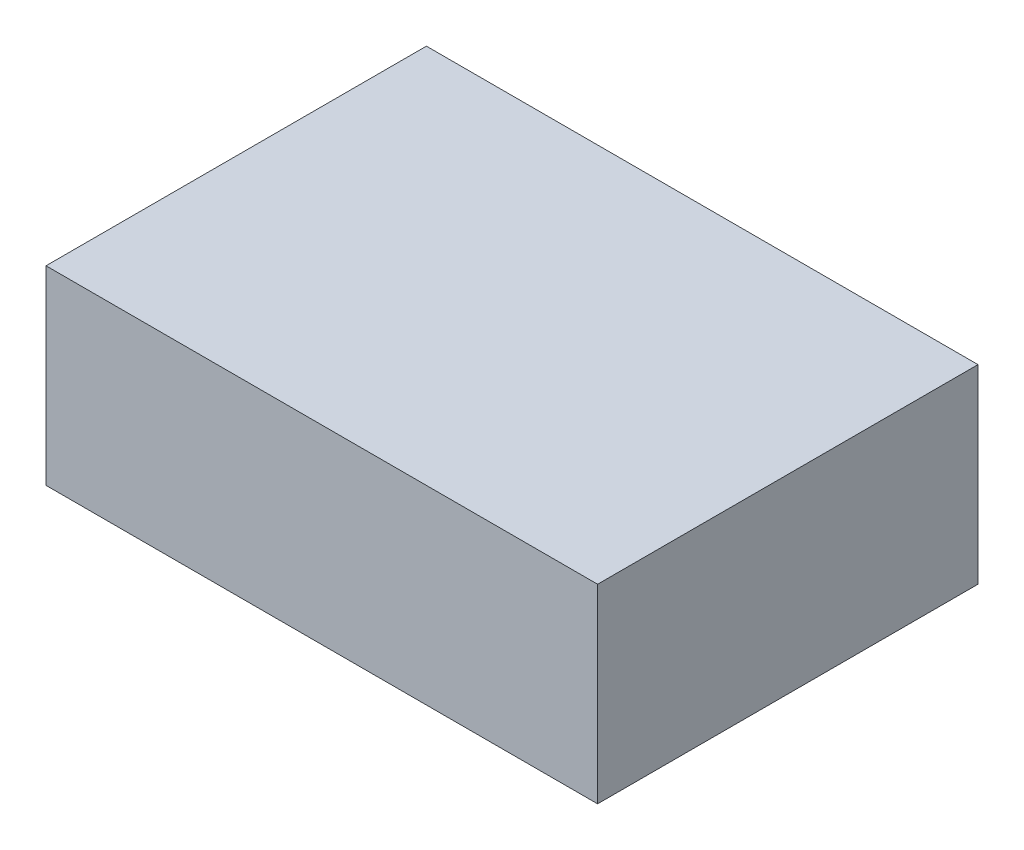
ISO-10303-21;
HEADER;
FILE_DESCRIPTION(('STEP AP214'),'2;1');
FILE_NAME('part.step','',(''),(''),'','','');
FILE_SCHEMA(('AUTOMOTIVE_DESIGN { 1 0 10303 214 1 1 1 1 }'));
ENDSEC;
DATA;
#1=APPLICATION_CONTEXT('core data for automotive mechanical design processes');
#2=APPLICATION_PROTOCOL_DEFINITION('international standard','automotive_design',2000,#1);
#3=PRODUCT_CONTEXT('',#1,'mechanical');
#4=PRODUCT('Part','Part','',(#3));
#5=PRODUCT_RELATED_PRODUCT_CATEGORY('part','',(#4));
#6=PRODUCT_DEFINITION_FORMATION('','',#4);
#7=PRODUCT_DEFINITION_CONTEXT('part definition',#1,'design');
#8=PRODUCT_DEFINITION('design','',#6,#7);
#9=PRODUCT_DEFINITION_SHAPE('','',#8);
#10=(LENGTH_UNIT() NAMED_UNIT(*) SI_UNIT(.MILLI.,.METRE.));
#11=(NAMED_UNIT(*) PLANE_ANGLE_UNIT() SI_UNIT($,.RADIAN.));
#12=(NAMED_UNIT(*) SI_UNIT($,.STERADIAN.) SOLID_ANGLE_UNIT());
#13=UNCERTAINTY_MEASURE_WITH_UNIT(LENGTH_MEASURE(1.E-05),#10,'distance_accuracy_value','');
#14=(GEOMETRIC_REPRESENTATION_CONTEXT(3) GLOBAL_UNCERTAINTY_ASSIGNED_CONTEXT((#13)) GLOBAL_UNIT_ASSIGNED_CONTEXT((#10,
#11,#12)) REPRESENTATION_CONTEXT('',''));
#15=CARTESIAN_POINT('',(0.,0.,0.));
#16=DIRECTION('',(0.,0.,1.));
#17=DIRECTION('',(1.,0.,0.));
#18=AXIS2_PLACEMENT_3D('',#15,#16,#17);
#19=CARTESIAN_POINT('',(0.72499982,0.2499995,0.));
#20=DIRECTION('',(0.,-1.,0.));
#21=DIRECTION('',(-1.,0.,0.));
#22=AXIS2_PLACEMENT_3D('',#19,#20,#21);
#23=PLANE('',#22);
#24=DIRECTION('',(-1.,0.,0.));
#25=VECTOR('',#24,1.);
#26=CARTESIAN_POINT('',(0.72499982,0.2499995,0.));
#27=LINE('',#26,#25);
#28=CARTESIAN_POINT('',(0.72499982,0.2499995,0.));
#29=VERTEX_POINT('',#28);
#30=CARTESIAN_POINT('',(-0.72499982,0.2499995,0.));
#31=VERTEX_POINT('',#30);
#32=EDGE_CURVE('E11',#29,#31,#27,.T.);
#33=ORIENTED_EDGE('',*,*,#32,.T.);
#34=DIRECTION('',(0.,0.,1.));
#35=VECTOR('',#34,1.);
#36=CARTESIAN_POINT('',(-0.72499982,0.2499995,0.));
#37=LINE('',#36,#35);
#38=CARTESIAN_POINT('',(-0.72499982,0.2499995,1.00000054));
#39=VERTEX_POINT('',#38);
#40=EDGE_CURVE('E24',#31,#39,#37,.T.);
#41=ORIENTED_EDGE('',*,*,#40,.T.);
#42=DIRECTION('',(-1.,0.,0.));
#43=VECTOR('',#42,1.);
#44=CARTESIAN_POINT('',(0.72499982,0.2499995,1.00000054));
#45=LINE('',#44,#43);
#46=CARTESIAN_POINT('',(0.72499982,0.2499995,1.00000054));
#47=VERTEX_POINT('',#46);
#48=EDGE_CURVE('E87',#47,#39,#45,.T.);
#49=ORIENTED_EDGE('',*,*,#48,.F.);
#50=DIRECTION('',(0.,0.,1.));
#51=VECTOR('',#50,1.);
#52=CARTESIAN_POINT('',(0.72499982,0.2499995,0.));
#53=LINE('',#52,#51);
#54=EDGE_CURVE('E36',#29,#47,#53,.T.);
#55=ORIENTED_EDGE('',*,*,#54,.F.);
#56=EDGE_LOOP('',(#33,#41,#49,#55));
#57=FACE_BOUND('',#56,.T.);
#58=ADVANCED_FACE('F17',(#57),#23,.F.);
#59=CARTESIAN_POINT('',(-0.72499982,0.2499995,0.));
#60=DIRECTION('',(1.,0.,0.));
#61=DIRECTION('',(0.,-1.,0.));
#62=AXIS2_PLACEMENT_3D('',#59,#60,#61);
#63=PLANE('',#62);
#64=DIRECTION('',(0.,-1.,0.));
#65=VECTOR('',#64,1.);
#66=CARTESIAN_POINT('',(-0.72499982,0.2499995,0.));
#67=LINE('',#66,#65);
#68=CARTESIAN_POINT('',(-0.72499982,-0.2499995,0.));
#69=VERTEX_POINT('',#68);
#70=EDGE_CURVE('E84',#31,#69,#67,.T.);
#71=ORIENTED_EDGE('',*,*,#70,.T.);
#72=DIRECTION('',(0.,0.,1.));
#73=VECTOR('',#72,1.);
#74=CARTESIAN_POINT('',(-0.72499982,-0.2499995,0.));
#75=LINE('',#74,#73);
#76=CARTESIAN_POINT('',(-0.72499982,-0.2499995,1.00000054));
#77=VERTEX_POINT('',#76);
#78=EDGE_CURVE('E82',#69,#77,#75,.T.);
#79=ORIENTED_EDGE('',*,*,#78,.T.);
#80=DIRECTION('',(0.,-1.,0.));
#81=VECTOR('',#80,1.);
#82=CARTESIAN_POINT('',(-0.72499982,0.2499995,1.00000054));
#83=LINE('',#82,#81);
#84=EDGE_CURVE('E62',#39,#77,#83,.T.);
#85=ORIENTED_EDGE('',*,*,#84,.F.);
#86=ORIENTED_EDGE('',*,*,#40,.F.);
#87=EDGE_LOOP('',(#71,#79,#85,#86));
#88=FACE_BOUND('',#87,.T.);
#89=ADVANCED_FACE('F89',(#88),#63,.F.);
#90=CARTESIAN_POINT('',(-0.72499982,-0.2499995,0.));
#91=DIRECTION('',(0.,1.,0.));
#92=DIRECTION('',(1.,0.,0.));
#93=AXIS2_PLACEMENT_3D('',#90,#91,#92);
#94=PLANE('',#93);
#95=DIRECTION('',(1.,0.,0.));
#96=VECTOR('',#95,1.);
#97=CARTESIAN_POINT('',(-0.72499982,-0.2499995,0.));
#98=LINE('',#97,#96);
#99=CARTESIAN_POINT('',(0.72499982,-0.2499995,0.));
#100=VERTEX_POINT('',#99);
#101=EDGE_CURVE('E71',#69,#100,#98,.T.);
#102=ORIENTED_EDGE('',*,*,#101,.T.);
#103=DIRECTION('',(0.,0.,1.));
#104=VECTOR('',#103,1.);
#105=CARTESIAN_POINT('',(0.72499982,-0.2499995,0.));
#106=LINE('',#105,#104);
#107=CARTESIAN_POINT('',(0.72499982,-0.2499995,1.00000054));
#108=VERTEX_POINT('',#107);
#109=EDGE_CURVE('E65',#100,#108,#106,.T.);
#110=ORIENTED_EDGE('',*,*,#109,.T.);
#111=DIRECTION('',(1.,0.,0.));
#112=VECTOR('',#111,1.);
#113=CARTESIAN_POINT('',(-0.72499982,-0.2499995,1.00000054));
#114=LINE('',#113,#112);
#115=EDGE_CURVE('E57',#77,#108,#114,.T.);
#116=ORIENTED_EDGE('',*,*,#115,.F.);
#117=ORIENTED_EDGE('',*,*,#78,.F.);
#118=EDGE_LOOP('',(#102,#110,#116,#117));
#119=FACE_BOUND('',#118,.T.);
#120=ADVANCED_FACE('F69',(#119),#94,.F.);
#121=CARTESIAN_POINT('',(0.72499982,-0.2499995,0.));
#122=DIRECTION('',(-1.,0.,0.));
#123=DIRECTION('',(0.,1.,0.));
#124=AXIS2_PLACEMENT_3D('',#121,#122,#123);
#125=PLANE('',#124);
#126=DIRECTION('',(0.,1.,0.));
#127=VECTOR('',#126,1.);
#128=CARTESIAN_POINT('',(0.72499982,-0.2499995,0.));
#129=LINE('',#128,#127);
#130=EDGE_CURVE('E66',#100,#29,#129,.T.);
#131=ORIENTED_EDGE('',*,*,#130,.T.);
#132=ORIENTED_EDGE('',*,*,#54,.T.);
#133=DIRECTION('',(0.,1.,0.));
#134=VECTOR('',#133,1.);
#135=CARTESIAN_POINT('',(0.72499982,-0.2499995,1.00000054));
#136=LINE('',#135,#134);
#137=EDGE_CURVE('E61',#108,#47,#136,.T.);
#138=ORIENTED_EDGE('',*,*,#137,.F.);
#139=ORIENTED_EDGE('',*,*,#109,.F.);
#140=EDGE_LOOP('',(#131,#132,#138,#139));
#141=FACE_BOUND('',#140,.T.);
#142=ADVANCED_FACE('F76',(#141),#125,.F.);
#143=CARTESIAN_POINT('',(0.72499982,0.2499995,0.));
#144=DIRECTION('',(0.,0.,-1.));
#145=DIRECTION('',(-1.,0.,0.));
#146=AXIS2_PLACEMENT_3D('',#143,#144,#145);
#147=PLANE('',#146);
#148=ORIENTED_EDGE('',*,*,#130,.F.);
#149=ORIENTED_EDGE('',*,*,#101,.F.);
#150=ORIENTED_EDGE('',*,*,#70,.F.);
#151=ORIENTED_EDGE('',*,*,#32,.F.);
#152=EDGE_LOOP('',(#148,#149,#150,#151));
#153=FACE_BOUND('',#152,.T.);
#154=ADVANCED_FACE('F91',(#153),#147,.T.);
#155=CARTESIAN_POINT('',(0.72499982,0.2499995,1.00000054));
#156=DIRECTION('',(0.,0.,-1.));
#157=DIRECTION('',(-1.,0.,0.));
#158=AXIS2_PLACEMENT_3D('',#155,#156,#157);
#159=PLANE('',#158);
#160=ORIENTED_EDGE('',*,*,#48,.T.);
#161=ORIENTED_EDGE('',*,*,#84,.T.);
#162=ORIENTED_EDGE('',*,*,#115,.T.);
#163=ORIENTED_EDGE('',*,*,#137,.T.);
#164=EDGE_LOOP('',(#160,#161,#162,#163));
#165=FACE_BOUND('',#164,.T.);
#166=ADVANCED_FACE('F59',(#165),#159,.F.);
#167=CLOSED_SHELL('',(#58,#89,#120,#142,#154,#166));
#168=MANIFOLD_SOLID_BREP('B1',#167);
#169=ADVANCED_BREP_SHAPE_REPRESENTATION('',(#18,#168),#14);
#170=SHAPE_DEFINITION_REPRESENTATION(#9,#169);
ENDSEC;
END-ISO-10303-21;
